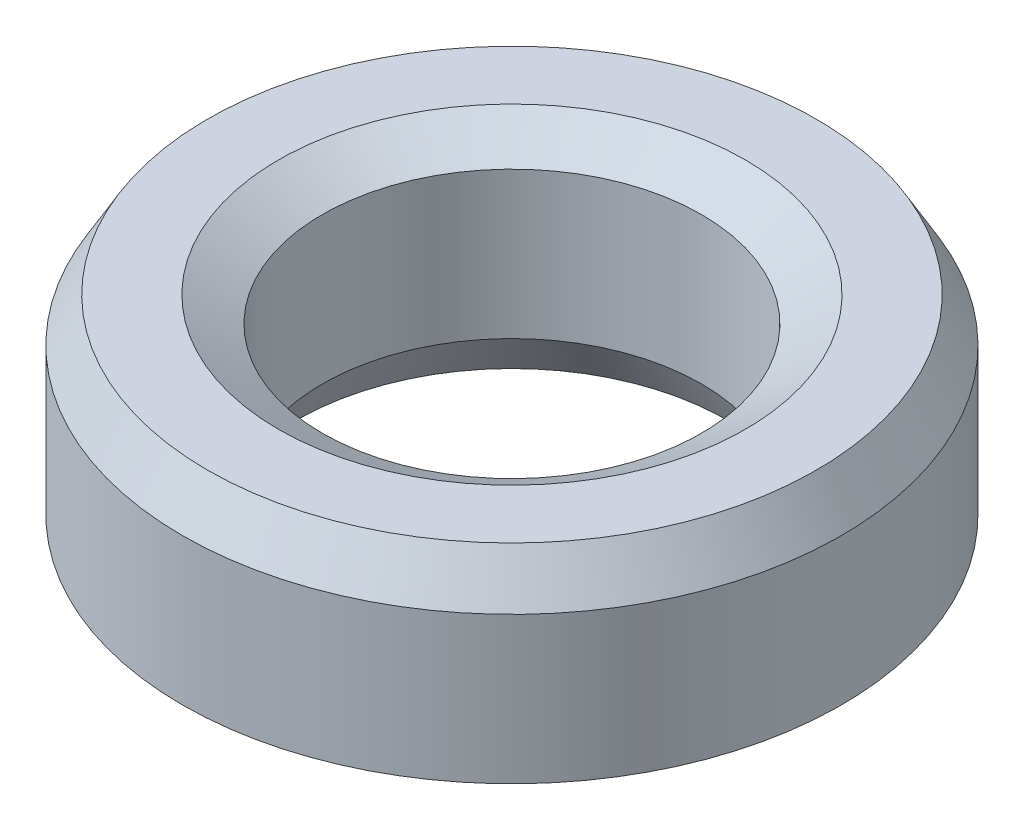
ISO-10303-21;
HEADER;
FILE_DESCRIPTION(('STEP AP214'),'2;1');
FILE_NAME('part.step','',(''),(''),'','','');
FILE_SCHEMA(('AUTOMOTIVE_DESIGN { 1 0 10303 214 1 1 1 1 }'));
ENDSEC;
DATA;
#1=APPLICATION_CONTEXT('core data for automotive mechanical design processes');
#2=APPLICATION_PROTOCOL_DEFINITION('international standard','automotive_design',2000,#1);
#3=PRODUCT_CONTEXT('',#1,'mechanical');
#4=PRODUCT('Part','Part','',(#3));
#5=PRODUCT_RELATED_PRODUCT_CATEGORY('part','',(#4));
#6=PRODUCT_DEFINITION_FORMATION('','',#4);
#7=PRODUCT_DEFINITION_CONTEXT('part definition',#1,'design');
#8=PRODUCT_DEFINITION('design','',#6,#7);
#9=PRODUCT_DEFINITION_SHAPE('','',#8);
#10=(LENGTH_UNIT() NAMED_UNIT(*) SI_UNIT(.MILLI.,.METRE.));
#11=(NAMED_UNIT(*) PLANE_ANGLE_UNIT() SI_UNIT($,.RADIAN.));
#12=(NAMED_UNIT(*) SI_UNIT($,.STERADIAN.) SOLID_ANGLE_UNIT());
#13=UNCERTAINTY_MEASURE_WITH_UNIT(LENGTH_MEASURE(1.E-05),#10,'distance_accuracy_value','');
#14=(GEOMETRIC_REPRESENTATION_CONTEXT(3) GLOBAL_UNCERTAINTY_ASSIGNED_CONTEXT((#13)) GLOBAL_UNIT_ASSIGNED_CONTEXT((#10,
#11,#12)) REPRESENTATION_CONTEXT('',''));
#15=CARTESIAN_POINT('',(0.,0.,0.));
#16=DIRECTION('',(0.,0.,1.));
#17=DIRECTION('',(1.,0.,0.));
#18=AXIS2_PLACEMENT_3D('',#15,#16,#17);
#19=CARTESIAN_POINT('',(0.,16.3806990246832,0.));
#20=DIRECTION('',(0.,-1.,0.));
#21=DIRECTION('',(0.,0.,-1.));
#22=AXIS2_PLACEMENT_3D('',#19,#20,#21);
#23=CYLINDRICAL_SURFACE('',#22,25.);
#24=CARTESIAN_POINT('',(0.,1.92229274465123,0.));
#25=DIRECTION('',(0.,1.,0.));
#26=DIRECTION('',(0.,0.,1.));
#27=AXIS2_PLACEMENT_3D('',#24,#25,#26);
#28=CIRCLE('',#27,25.);
#29=CARTESIAN_POINT('',(0.,1.92229274465123,25.));
#30=VERTEX_POINT('',#29);
#31=EDGE_CURVE('E10',#30,#30,#28,.T.);
#32=ORIENTED_EDGE('',*,*,#31,.T.);
#33=EDGE_LOOP('',(#32));
#34=FACE_BOUND('',#33,.T.);
#35=CARTESIAN_POINT('',(0.,13.0511903239262,0.));
#36=DIRECTION('',(0.,1.,0.));
#37=DIRECTION('',(0.,0.,1.));
#38=AXIS2_PLACEMENT_3D('',#35,#36,#37);
#39=CIRCLE('',#38,25.);
#40=CARTESIAN_POINT('',(0.,13.0511903239262,25.));
#41=VERTEX_POINT('',#40);
#42=EDGE_CURVE('E50',#41,#41,#39,.F.);
#43=ORIENTED_EDGE('',*,*,#42,.T.);
#44=EDGE_LOOP('',(#43));
#45=FACE_BOUND('',#44,.T.);
#46=ADVANCED_FACE('F39',(#34,#45),#23,.T.);
#47=CARTESIAN_POINT('',(0.,16.3806990246832,0.));
#48=DIRECTION('',(0.,1.,0.));
#49=DIRECTION('',(0.,0.,1.));
#50=AXIS2_PLACEMENT_3D('',#47,#48,#49);
#51=PLANE('',#50);
#52=CARTESIAN_POINT('',(0.,16.3806990246832,0.));
#53=DIRECTION('',(0.,1.,0.));
#54=DIRECTION('',(0.,0.,1.));
#55=AXIS2_PLACEMENT_3D('',#52,#53,#54);
#56=CIRCLE('',#55,17.7059318099461);
#57=CARTESIAN_POINT('',(0.,16.3806990246832,17.7059318099461));
#58=VERTEX_POINT('',#57);
#59=EDGE_CURVE('E58',#58,#58,#56,.F.);
#60=ORIENTED_EDGE('',*,*,#59,.T.);
#61=EDGE_LOOP('',(#60));
#62=FACE_BOUND('',#61,.T.);
#63=CARTESIAN_POINT('',(0.,16.3806990246832,0.));
#64=DIRECTION('',(0.,1.,0.));
#65=DIRECTION('',(0.,0.,1.));
#66=AXIS2_PLACEMENT_3D('',#63,#64,#65);
#67=CIRCLE('',#66,23.0777072553488);
#68=CARTESIAN_POINT('',(0.,16.3806990246832,23.0777072553488));
#69=VERTEX_POINT('',#68);
#70=EDGE_CURVE('E61',#69,#69,#67,.T.);
#71=ORIENTED_EDGE('',*,*,#70,.T.);
#72=EDGE_LOOP('',(#71));
#73=FACE_BOUND('',#72,.T.);
#74=ADVANCED_FACE('F88',(#62,#73),#51,.T.);
#75=CARTESIAN_POINT('',(0.,0.,0.));
#76=DIRECTION('',(0.,1.,0.));
#77=DIRECTION('',(0.,0.,1.));
#78=AXIS2_PLACEMENT_3D('',#75,#76,#77);
#79=PLANE('',#78);
#80=CARTESIAN_POINT('',(0.,0.,0.));
#81=DIRECTION('',(0.,1.,0.));
#82=DIRECTION('',(0.,0.,1.));
#83=AXIS2_PLACEMENT_3D('',#80,#81,#82);
#84=CIRCLE('',#83,16.2987158538403);
#85=CARTESIAN_POINT('',(0.,0.,16.2987158538403));
#86=VERTEX_POINT('',#85);
#87=EDGE_CURVE('E51',#86,#86,#84,.T.);
#88=ORIENTED_EDGE('',*,*,#87,.T.);
#89=EDGE_LOOP('',(#88));
#90=FACE_BOUND('',#89,.T.);
#91=CARTESIAN_POINT('',(0.,0.,0.));
#92=DIRECTION('',(0.,1.,0.));
#93=DIRECTION('',(0.,0.,1.));
#94=AXIS2_PLACEMENT_3D('',#91,#92,#93);
#95=CIRCLE('',#94,21.670491299243);
#96=CARTESIAN_POINT('',(0.,0.,21.670491299243));
#97=VERTEX_POINT('',#96);
#98=EDGE_CURVE('E54',#97,#97,#95,.F.);
#99=ORIENTED_EDGE('',*,*,#98,.T.);
#100=EDGE_LOOP('',(#99));
#101=FACE_BOUND('',#100,.T.);
#102=ADVANCED_FACE('F83',(#90,#101),#79,.F.);
#103=CARTESIAN_POINT('',(0.,16.3806990246832,0.));
#104=DIRECTION('',(0.,-1.,0.));
#105=DIRECTION('',(0.,0.,-1.));
#106=AXIS2_PLACEMENT_3D('',#103,#104,#105);
#107=CYLINDRICAL_SURFACE('',#106,14.3764231091891);
#108=CARTESIAN_POINT('',(0.,14.458406280032,0.));
#109=DIRECTION('',(0.,1.,0.));
#110=DIRECTION('',(0.,0.,1.));
#111=AXIS2_PLACEMENT_3D('',#108,#109,#110);
#112=CIRCLE('',#111,14.3764231091891);
#113=CARTESIAN_POINT('',(0.,14.458406280032,14.3764231091891));
#114=VERTEX_POINT('',#113);
#115=EDGE_CURVE('E67',#114,#114,#112,.T.);
#116=ORIENTED_EDGE('',*,*,#115,.T.);
#117=EDGE_LOOP('',(#116));
#118=FACE_BOUND('',#117,.T.);
#119=CARTESIAN_POINT('',(0.,3.329508700757,0.));
#120=DIRECTION('',(0.,1.,0.));
#121=DIRECTION('',(0.,0.,1.));
#122=AXIS2_PLACEMENT_3D('',#119,#120,#121);
#123=CIRCLE('',#122,14.3764231091891);
#124=CARTESIAN_POINT('',(0.,3.329508700757,14.3764231091891));
#125=VERTEX_POINT('',#124);
#126=EDGE_CURVE('E69',#125,#125,#123,.F.);
#127=ORIENTED_EDGE('',*,*,#126,.T.);
#128=EDGE_LOOP('',(#127));
#129=FACE_BOUND('',#128,.T.);
#130=ADVANCED_FACE('F71',(#118,#129),#107,.F.);
#131=CARTESIAN_POINT('',(0.,14.458406280032,0.));
#132=DIRECTION('',(0.,1.,0.));
#133=DIRECTION('',(0.,0.,1.));
#134=AXIS2_PLACEMENT_3D('',#131,#132,#133);
#135=CONICAL_SURFACE('',#134,14.3764231091891,1.0471975511966);
#136=ORIENTED_EDGE('',*,*,#59,.F.);
#137=EDGE_LOOP('',(#136));
#138=FACE_BOUND('',#137,.T.);
#139=ORIENTED_EDGE('',*,*,#115,.F.);
#140=EDGE_LOOP('',(#139));
#141=FACE_BOUND('',#140,.T.);
#142=ADVANCED_FACE('F77',(#138,#141),#135,.F.);
#143=CARTESIAN_POINT('',(0.,0.,0.));
#144=DIRECTION('',(0.,-1.,0.));
#145=DIRECTION('',(0.,0.,-1.));
#146=AXIS2_PLACEMENT_3D('',#143,#144,#145);
#147=CONICAL_SURFACE('',#146,16.2987158538403,0.523598775598297);
#148=ORIENTED_EDGE('',*,*,#126,.F.);
#149=EDGE_LOOP('',(#148));
#150=FACE_BOUND('',#149,.T.);
#151=ORIENTED_EDGE('',*,*,#87,.F.);
#152=EDGE_LOOP('',(#151));
#153=FACE_BOUND('',#152,.T.);
#154=ADVANCED_FACE('F73',(#150,#153),#147,.F.);
#155=CARTESIAN_POINT('',(0.,1.92229274465123,0.));
#156=DIRECTION('',(0.,1.,0.));
#157=DIRECTION('',(0.,0.,1.));
#158=AXIS2_PLACEMENT_3D('',#155,#156,#157);
#159=CONICAL_SURFACE('',#158,25.,1.0471975511966);
#160=CARTESIAN_POINT('',(0.,0.,21.670491299243));
#161=CARTESIAN_POINT('',(0.,0.0200238827567833,21.7051736815426));
#162=CARTESIAN_POINT('',(0.,0.040047765513567,21.7398560638421));
#163=CARTESIAN_POINT('',(0.,0.0800955310271344,21.8092208284412));
#164=CARTESIAN_POINT('',(0.,0.100119413783918,21.8439032107408));
#165=CARTESIAN_POINT('',(0.,0.140167179297485,21.9132679753399));
#166=CARTESIAN_POINT('',(0.,0.160191062054268,21.9479503576394));
#167=CARTESIAN_POINT('',(0.,0.200238827567836,22.0173151222385));
#168=CARTESIAN_POINT('',(0.,0.22026271032462,22.0519975045381));
#169=CARTESIAN_POINT('',(0.,0.260310475838187,22.1213622691372));
#170=CARTESIAN_POINT('',(0.,0.28033435859497,22.1560446514368));
#171=CARTESIAN_POINT('',(0.,0.320382124108538,22.2254094160359));
#172=CARTESIAN_POINT('',(0.,0.340406006865321,22.2600917983354));
#173=CARTESIAN_POINT('',(0.,0.380453772378889,22.3294565629345));
#174=CARTESIAN_POINT('',(0.,0.400477655135672,22.3641389452341));
#175=CARTESIAN_POINT('',(0.,0.440525420649239,22.4335037098332));
#176=CARTESIAN_POINT('',(0.,0.460549303406023,22.4681860921327));
#177=CARTESIAN_POINT('',(0.,0.50059706891959,22.5375508567318));
#178=CARTESIAN_POINT('',(0.,0.520620951676374,22.5722332390314));
#179=CARTESIAN_POINT('',(0.,0.560668717189941,22.6415980036305));
#180=CARTESIAN_POINT('',(0.,0.580692599946724,22.67628038593));
#181=CARTESIAN_POINT('',(0.,0.620740365460292,22.7456451505291));
#182=CARTESIAN_POINT('',(0.,0.640764248217076,22.7803275328287));
#183=CARTESIAN_POINT('',(0.,0.680812013730643,22.8496922974278));
#184=CARTESIAN_POINT('',(0.,0.700835896487427,22.8843746797273));
#185=CARTESIAN_POINT('',(0.,0.740883662000994,22.9537394443264));
#186=CARTESIAN_POINT('',(0.,0.760907544757777,22.988421826626));
#187=CARTESIAN_POINT('',(0.,0.800955310271344,23.0577865912251));
#188=CARTESIAN_POINT('',(0.,0.820979193028128,23.0924689735246));
#189=CARTESIAN_POINT('',(0.,0.861026958541695,23.1618337381238));
#190=CARTESIAN_POINT('',(0.,0.881050841298479,23.1965161204233));
#191=CARTESIAN_POINT('',(0.,0.921098606812046,23.2658808850224));
#192=CARTESIAN_POINT('',(0.,0.94112248956883,23.300563267322));
#193=CARTESIAN_POINT('',(0.,0.981170255082397,23.3699280319211));
#194=CARTESIAN_POINT('',(0.,1.00119413783918,23.4046104142206));
#195=CARTESIAN_POINT('',(0.,1.04124190335275,23.4739751788197));
#196=CARTESIAN_POINT('',(0.,1.06126578610953,23.5086575611193));
#197=CARTESIAN_POINT('',(0.,1.1013135516231,23.5780223257184));
#198=CARTESIAN_POINT('',(0.,1.12133743437988,23.6127047080179));
#199=CARTESIAN_POINT('',(0.,1.16138519989345,23.682069472617));
#200=CARTESIAN_POINT('',(0.,1.18140908265023,23.7167518549166));
#201=CARTESIAN_POINT('',(0.,1.2214568481638,23.7861166195157));
#202=CARTESIAN_POINT('',(0.,1.24148073092058,23.8207990018152));
#203=CARTESIAN_POINT('',(0.,1.28152849643415,23.8901637664143));
#204=CARTESIAN_POINT('',(0.,1.30155237919093,23.9248461487139));
#205=CARTESIAN_POINT('',(0.,1.3416001447045,23.994210913313));
#206=CARTESIAN_POINT('',(0.,1.36162402746129,24.0288932956126));
#207=CARTESIAN_POINT('',(0.,1.40167179297485,24.0982580602117));
#208=CARTESIAN_POINT('',(0.,1.42169567573164,24.1329404425112));
#209=CARTESIAN_POINT('',(0.,1.4617434412452,24.2023052071103));
#210=CARTESIAN_POINT('',(0.,1.48176732400199,24.2369875894099));
#211=CARTESIAN_POINT('',(0.,1.52181508951555,24.306352354009));
#212=CARTESIAN_POINT('',(0.,1.54183897227234,24.3410347363085));
#213=CARTESIAN_POINT('',(0.,1.58188673778591,24.4103995009076));
#214=CARTESIAN_POINT('',(0.,1.60191062054269,24.4450818832072));
#215=CARTESIAN_POINT('',(0.,1.64195838605626,24.5144466478063));
#216=CARTESIAN_POINT('',(0.,1.66198226881304,24.5491290301058));
#217=CARTESIAN_POINT('',(0.,1.70203003432661,24.6184937947049));
#218=CARTESIAN_POINT('',(0.,1.72205391708339,24.6531761770045));
#219=CARTESIAN_POINT('',(0.,1.76210168259696,24.7225409416036));
#220=CARTESIAN_POINT('',(0.,1.78212556535374,24.7572233239031));
#221=CARTESIAN_POINT('',(0.,1.82217333086731,24.8265880885022));
#222=CARTESIAN_POINT('',(0.,1.84219721362409,24.8612704708018));
#223=CARTESIAN_POINT('',(0.,1.88224497913766,24.9306352354009));
#224=CARTESIAN_POINT('',(0.,1.90226886189444,24.9653176177004));
#225=CARTESIAN_POINT('',(0.,1.92229274465123,25.));
#226=B_SPLINE_CURVE_WITH_KNOTS('',3,(#160,#161,#162,#163,#164,#165,#166,#167,#168,#169,#170,
#171,#172,#173,#174,#175,#176,#177,#178,#179,#180,#181,#182,#183,#184,#185,#186,#187,#188,#189,
#190,#191,#192,#193,#194,#195,#196,#197,#198,#199,#200,#201,#202,#203,#204,#205,#206,#207,#208,
#209,#210,#211,#212,#213,#214,#215,#216,#217,#218,#219,#220,#221,#222,#223,#224,#225),
.UNSPECIFIED.,.F.,.F.,(4,2,2,2,2,2,2,2,2,2,2,2,2,2,2,2,2,2,2,2,2,2,2,2,2,2,2,2,2,2,2,2,4),(0.,
0.120143296540703,0.240286593081405,0.360429889622108,0.480573186162808,0.600716482703511,
0.720859779244213,0.841003075784916,0.961146372325619,1.08128966886632,1.20143296540702,
1.32157626194772,1.44171955848843,1.56186285502913,1.68200615156983,1.80214944811053,
1.92229274465124,2.04243604119194,2.16257933773264,2.28272263427335,2.40286593081405,
2.52300922735475,2.64315252389545,2.76329582043615,2.88343911697686,3.00358241351756,
3.12372571005826,3.24386900659896,3.36401230313967,3.48415559968037,3.60429889622107,
3.72444219276177,3.84458548930247),.UNSPECIFIED.);
#227=EDGE_CURVE('BSEAM76',#97,#30,#226,.T.);
#228=ORIENTED_EDGE('',*,*,#98,.F.);
#229=ORIENTED_EDGE('',*,*,#31,.F.);
#230=ORIENTED_EDGE('',*,*,#227,.T.);
#231=ORIENTED_EDGE('',*,*,#227,.F.);
#232=EDGE_LOOP('',(#228,#230,#229,#231));
#233=FACE_BOUND('',#232,.T.);
#234=ADVANCED_FACE('F76',(#233),#159,.T.);
#235=CARTESIAN_POINT('',(0.,16.3806990246832,0.));
#236=DIRECTION('',(0.,-1.,0.));
#237=DIRECTION('',(0.,0.,-1.));
#238=AXIS2_PLACEMENT_3D('',#235,#236,#237);
#239=CONICAL_SURFACE('',#238,23.0777072553488,0.523598775598295);
#240=ORIENTED_EDGE('',*,*,#42,.F.);
#241=EDGE_LOOP('',(#240));
#242=FACE_BOUND('',#241,.T.);
#243=ORIENTED_EDGE('',*,*,#70,.F.);
#244=EDGE_LOOP('',(#243));
#245=FACE_BOUND('',#244,.T.);
#246=ADVANCED_FACE('F45',(#242,#245),#239,.T.);
#247=CLOSED_SHELL('',(#46,#74,#102,#130,#142,#154,#234,#246));
#248=MANIFOLD_SOLID_BREP('B2',#247);
#249=ADVANCED_BREP_SHAPE_REPRESENTATION('',(#18,#248),#14);
#250=SHAPE_DEFINITION_REPRESENTATION(#9,#249);
ENDSEC;
END-ISO-10303-21;
